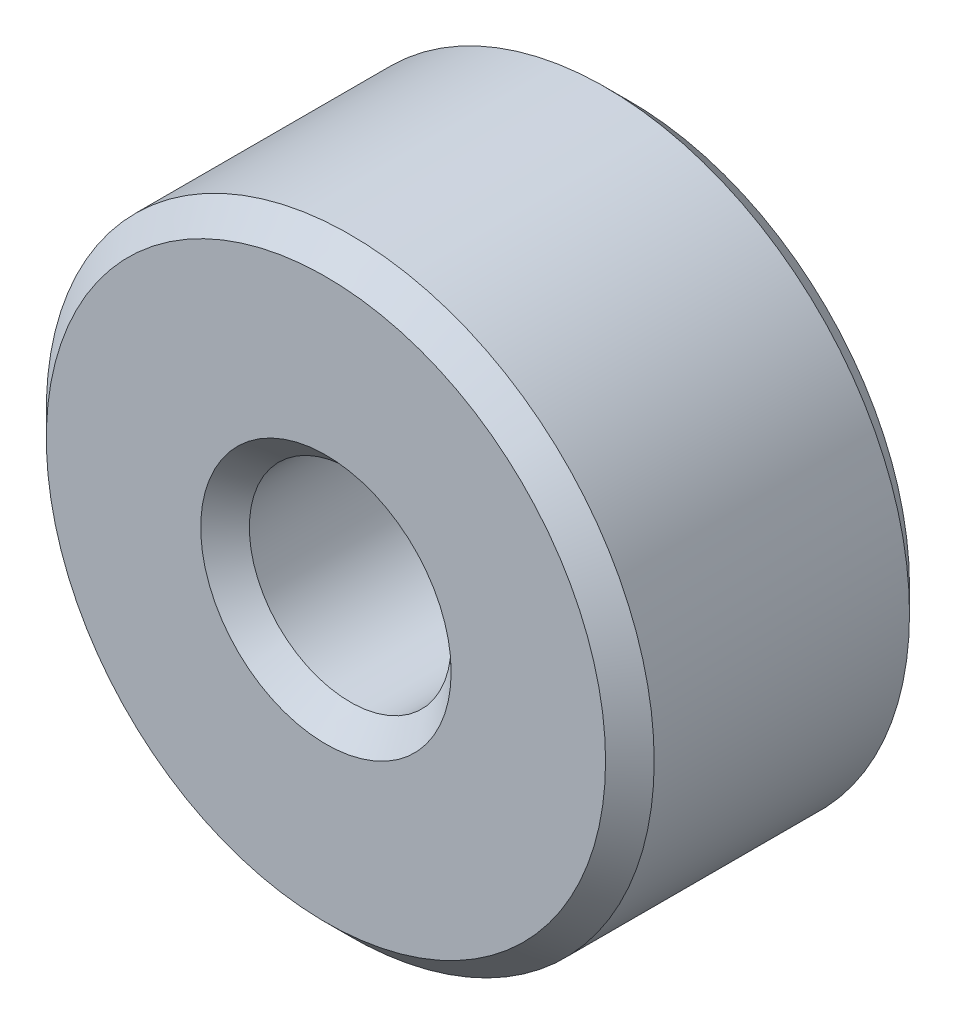
ISO-10303-21;
HEADER;
FILE_DESCRIPTION(('STEP AP214'),'2;1');
FILE_NAME('part.step','',(''),(''),'','','');
FILE_SCHEMA(('AUTOMOTIVE_DESIGN { 1 0 10303 214 1 1 1 1 }'));
ENDSEC;
DATA;
#1=APPLICATION_CONTEXT('core data for automotive mechanical design processes');
#2=APPLICATION_PROTOCOL_DEFINITION('international standard','automotive_design',2000,#1);
#3=PRODUCT_CONTEXT('',#1,'mechanical');
#4=PRODUCT('Part','Part','',(#3));
#5=PRODUCT_RELATED_PRODUCT_CATEGORY('part','',(#4));
#6=PRODUCT_DEFINITION_FORMATION('','',#4);
#7=PRODUCT_DEFINITION_CONTEXT('part definition',#1,'design');
#8=PRODUCT_DEFINITION('design','',#6,#7);
#9=PRODUCT_DEFINITION_SHAPE('','',#8);
#10=(LENGTH_UNIT() NAMED_UNIT(*) SI_UNIT(.MILLI.,.METRE.));
#11=(NAMED_UNIT(*) PLANE_ANGLE_UNIT() SI_UNIT($,.RADIAN.));
#12=(NAMED_UNIT(*) SI_UNIT($,.STERADIAN.) SOLID_ANGLE_UNIT());
#13=UNCERTAINTY_MEASURE_WITH_UNIT(LENGTH_MEASURE(1.E-05),#10,'distance_accuracy_value','');
#14=(GEOMETRIC_REPRESENTATION_CONTEXT(3) GLOBAL_UNCERTAINTY_ASSIGNED_CONTEXT((#13)) GLOBAL_UNIT_ASSIGNED_CONTEXT((#10,
#11,#12)) REPRESENTATION_CONTEXT('',''));
#15=CARTESIAN_POINT('',(0.,0.,0.));
#16=DIRECTION('',(0.,0.,1.));
#17=DIRECTION('',(1.,0.,0.));
#18=AXIS2_PLACEMENT_3D('',#15,#16,#17);
#19=CARTESIAN_POINT('',(0.,0.,-3.175));
#20=DIRECTION('',(0.,0.,1.));
#21=DIRECTION('',(1.,0.,0.));
#22=AXIS2_PLACEMENT_3D('',#19,#20,#21);
#23=CYLINDRICAL_SURFACE('',#22,6.35);
#24=CARTESIAN_POINT('',(0.,0.,-2.667));
#25=DIRECTION('',(0.,0.,1.));
#26=DIRECTION('',(1.,0.,0.));
#27=AXIS2_PLACEMENT_3D('',#24,#25,#26);
#28=CIRCLE('',#27,6.35);
#29=CARTESIAN_POINT('',(6.35,0.,-2.667));
#30=VERTEX_POINT('',#29);
#31=EDGE_CURVE('E10',#30,#30,#28,.T.);
#32=ORIENTED_EDGE('',*,*,#31,.T.);
#33=EDGE_LOOP('',(#32));
#34=FACE_BOUND('',#33,.T.);
#35=CARTESIAN_POINT('',(0.,0.,2.667));
#36=DIRECTION('',(0.,0.,1.));
#37=DIRECTION('',(1.,0.,0.));
#38=AXIS2_PLACEMENT_3D('',#35,#36,#37);
#39=CIRCLE('',#38,6.35);
#40=CARTESIAN_POINT('',(6.35,0.,2.667));
#41=VERTEX_POINT('',#40);
#42=EDGE_CURVE('E44',#41,#41,#39,.F.);
#43=ORIENTED_EDGE('',*,*,#42,.T.);
#44=EDGE_LOOP('',(#43));
#45=FACE_BOUND('',#44,.T.);
#46=ADVANCED_FACE('F37',(#34,#45),#23,.T.);
#47=CARTESIAN_POINT('',(0.,0.,-3.175));
#48=DIRECTION('',(0.,0.,1.));
#49=DIRECTION('',(1.,0.,0.));
#50=AXIS2_PLACEMENT_3D('',#47,#48,#49);
#51=PLANE('',#50);
#52=CARTESIAN_POINT('',(0.,0.,-3.175));
#53=DIRECTION('',(0.,0.,1.));
#54=DIRECTION('',(1.,0.,0.));
#55=AXIS2_PLACEMENT_3D('',#52,#53,#54);
#56=CIRCLE('',#55,2.6162);
#57=CARTESIAN_POINT('',(2.6162,0.,-3.175));
#58=VERTEX_POINT('',#57);
#59=EDGE_CURVE('E63',#58,#58,#56,.T.);
#60=ORIENTED_EDGE('',*,*,#59,.T.);
#61=EDGE_LOOP('',(#60));
#62=FACE_BOUND('',#61,.T.);
#63=CARTESIAN_POINT('',(0.,0.,-3.175));
#64=DIRECTION('',(0.,0.,1.));
#65=DIRECTION('',(1.,0.,0.));
#66=AXIS2_PLACEMENT_3D('',#63,#64,#65);
#67=CIRCLE('',#66,5.842);
#68=CARTESIAN_POINT('',(5.842,0.,-3.175));
#69=VERTEX_POINT('',#68);
#70=EDGE_CURVE('E66',#69,#69,#67,.F.);
#71=ORIENTED_EDGE('',*,*,#70,.T.);
#72=EDGE_LOOP('',(#71));
#73=FACE_BOUND('',#72,.T.);
#74=ADVANCED_FACE('F70',(#62,#73),#51,.F.);
#75=CARTESIAN_POINT('',(0.,0.,-3.175));
#76=DIRECTION('',(0.,0.,1.));
#77=DIRECTION('',(1.,0.,0.));
#78=AXIS2_PLACEMENT_3D('',#75,#76,#77);
#79=CYLINDRICAL_SURFACE('',#78,2.1082);
#80=CARTESIAN_POINT('',(0.,0.,-2.667));
#81=DIRECTION('',(0.,0.,1.));
#82=DIRECTION('',(1.,0.,0.));
#83=AXIS2_PLACEMENT_3D('',#80,#81,#82);
#84=CIRCLE('',#83,2.1082);
#85=CARTESIAN_POINT('',(2.1082,0.,-2.667));
#86=VERTEX_POINT('',#85);
#87=EDGE_CURVE('E57',#86,#86,#84,.F.);
#88=ORIENTED_EDGE('',*,*,#87,.T.);
#89=EDGE_LOOP('',(#88));
#90=FACE_BOUND('',#89,.T.);
#91=CARTESIAN_POINT('',(0.,0.,2.667));
#92=DIRECTION('',(0.,0.,1.));
#93=DIRECTION('',(1.,0.,0.));
#94=AXIS2_PLACEMENT_3D('',#91,#92,#93);
#95=CIRCLE('',#94,2.1082);
#96=CARTESIAN_POINT('',(2.1082,0.,2.667));
#97=VERTEX_POINT('',#96);
#98=EDGE_CURVE('E60',#97,#97,#95,.T.);
#99=ORIENTED_EDGE('',*,*,#98,.T.);
#100=EDGE_LOOP('',(#99));
#101=FACE_BOUND('',#100,.T.);
#102=ADVANCED_FACE('F89',(#90,#101),#79,.F.);
#103=CARTESIAN_POINT('',(0.,0.,3.175));
#104=DIRECTION('',(0.,0.,1.));
#105=DIRECTION('',(1.,0.,0.));
#106=AXIS2_PLACEMENT_3D('',#103,#104,#105);
#107=PLANE('',#106);
#108=CARTESIAN_POINT('',(0.,0.,3.175));
#109=DIRECTION('',(0.,0.,1.));
#110=DIRECTION('',(1.,0.,0.));
#111=AXIS2_PLACEMENT_3D('',#108,#109,#110);
#112=CIRCLE('',#111,2.6162);
#113=CARTESIAN_POINT('',(2.6162,0.,3.175));
#114=VERTEX_POINT('',#113);
#115=EDGE_CURVE('E48',#114,#114,#112,.F.);
#116=ORIENTED_EDGE('',*,*,#115,.T.);
#117=EDGE_LOOP('',(#116));
#118=FACE_BOUND('',#117,.T.);
#119=CARTESIAN_POINT('',(0.,0.,3.175));
#120=DIRECTION('',(0.,0.,1.));
#121=DIRECTION('',(1.,0.,0.));
#122=AXIS2_PLACEMENT_3D('',#119,#120,#121);
#123=CIRCLE('',#122,5.842);
#124=CARTESIAN_POINT('',(5.842,0.,3.175));
#125=VERTEX_POINT('',#124);
#126=EDGE_CURVE('E52',#125,#125,#123,.T.);
#127=ORIENTED_EDGE('',*,*,#126,.T.);
#128=EDGE_LOOP('',(#127));
#129=FACE_BOUND('',#128,.T.);
#130=ADVANCED_FACE('F95',(#118,#129),#107,.T.);
#131=CARTESIAN_POINT('',(0.,0.,-3.175));
#132=DIRECTION('',(0.,0.,-1.));
#133=DIRECTION('',(-1.,0.,0.));
#134=AXIS2_PLACEMENT_3D('',#131,#132,#133);
#135=CONICAL_SURFACE('',#134,2.6162,0.785398163397447);
#136=ORIENTED_EDGE('',*,*,#87,.F.);
#137=EDGE_LOOP('',(#136));
#138=FACE_BOUND('',#137,.T.);
#139=ORIENTED_EDGE('',*,*,#59,.F.);
#140=EDGE_LOOP('',(#139));
#141=FACE_BOUND('',#140,.T.);
#142=ADVANCED_FACE('F81',(#138,#141),#135,.F.);
#143=CARTESIAN_POINT('',(0.,0.,2.667));
#144=DIRECTION('',(0.,0.,1.));
#145=DIRECTION('',(1.,0.,0.));
#146=AXIS2_PLACEMENT_3D('',#143,#144,#145);
#147=CONICAL_SURFACE('',#146,2.1082,0.785398163397449);
#148=ORIENTED_EDGE('',*,*,#115,.F.);
#149=EDGE_LOOP('',(#148));
#150=FACE_BOUND('',#149,.T.);
#151=ORIENTED_EDGE('',*,*,#98,.F.);
#152=EDGE_LOOP('',(#151));
#153=FACE_BOUND('',#152,.T.);
#154=ADVANCED_FACE('F75',(#150,#153),#147,.F.);
#155=CARTESIAN_POINT('',(0.,0.,-2.667));
#156=DIRECTION('',(0.,0.,1.));
#157=DIRECTION('',(1.,0.,0.));
#158=AXIS2_PLACEMENT_3D('',#155,#156,#157);
#159=CONICAL_SURFACE('',#158,6.35,0.785398163397451);
#160=ORIENTED_EDGE('',*,*,#70,.F.);
#161=EDGE_LOOP('',(#160));
#162=FACE_BOUND('',#161,.T.);
#163=ORIENTED_EDGE('',*,*,#31,.F.);
#164=EDGE_LOOP('',(#163));
#165=FACE_BOUND('',#164,.T.);
#166=ADVANCED_FACE('F72',(#162,#165),#159,.T.);
#167=CARTESIAN_POINT('',(0.,0.,3.175));
#168=DIRECTION('',(0.,0.,-1.));
#169=DIRECTION('',(-1.,0.,0.));
#170=AXIS2_PLACEMENT_3D('',#167,#168,#169);
#171=CONICAL_SURFACE('',#170,5.842,0.785398163397448);
#172=ORIENTED_EDGE('',*,*,#42,.F.);
#173=EDGE_LOOP('',(#172));
#174=FACE_BOUND('',#173,.T.);
#175=ORIENTED_EDGE('',*,*,#126,.F.);
#176=EDGE_LOOP('',(#175));
#177=FACE_BOUND('',#176,.T.);
#178=ADVANCED_FACE('F39',(#174,#177),#171,.T.);
#179=CLOSED_SHELL('',(#46,#74,#102,#130,#142,#154,#166,#178));
#180=MANIFOLD_SOLID_BREP('B2',#179);
#181=ADVANCED_BREP_SHAPE_REPRESENTATION('',(#18,#180),#14);
#182=SHAPE_DEFINITION_REPRESENTATION(#9,#181);
ENDSEC;
END-ISO-10303-21;
